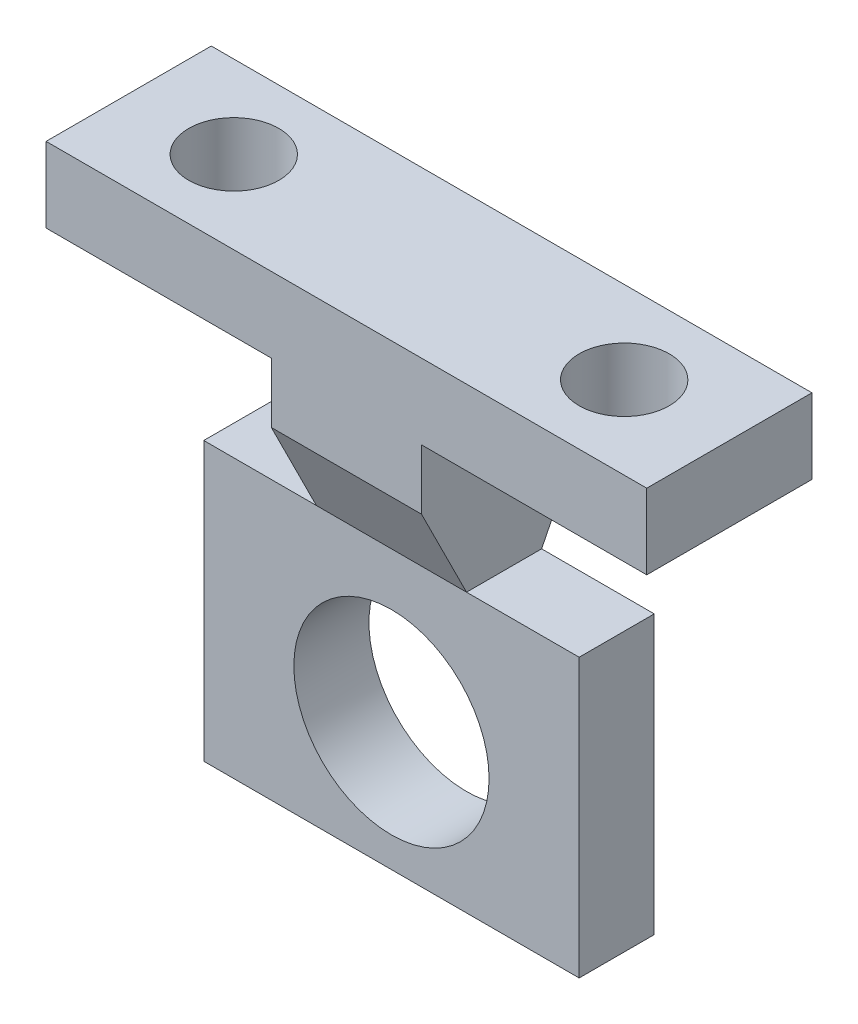
ISO-10303-21;
HEADER;
FILE_DESCRIPTION(('STEP AP214'),'2;1');
FILE_NAME('part.step','',(''),(''),'','','');
FILE_SCHEMA(('AUTOMOTIVE_DESIGN { 1 0 10303 214 1 1 1 1 }'));
ENDSEC;
DATA;
#1=APPLICATION_CONTEXT('core data for automotive mechanical design processes');
#2=APPLICATION_PROTOCOL_DEFINITION('international standard','automotive_design',2000,#1);
#3=PRODUCT_CONTEXT('',#1,'mechanical');
#4=PRODUCT('Part','Part','',(#3));
#5=PRODUCT_RELATED_PRODUCT_CATEGORY('part','',(#4));
#6=PRODUCT_DEFINITION_FORMATION('','',#4);
#7=PRODUCT_DEFINITION_CONTEXT('part definition',#1,'design');
#8=PRODUCT_DEFINITION('design','',#6,#7);
#9=PRODUCT_DEFINITION_SHAPE('','',#8);
#10=(LENGTH_UNIT() NAMED_UNIT(*) SI_UNIT(.MILLI.,.METRE.));
#11=(NAMED_UNIT(*) PLANE_ANGLE_UNIT() SI_UNIT($,.RADIAN.));
#12=(NAMED_UNIT(*) SI_UNIT($,.STERADIAN.) SOLID_ANGLE_UNIT());
#13=UNCERTAINTY_MEASURE_WITH_UNIT(LENGTH_MEASURE(1.E-05),#10,'distance_accuracy_value','');
#14=(GEOMETRIC_REPRESENTATION_CONTEXT(3) GLOBAL_UNCERTAINTY_ASSIGNED_CONTEXT((#13)) GLOBAL_UNIT_ASSIGNED_CONTEXT((#10,
#11,#12)) REPRESENTATION_CONTEXT('',''));
#15=CARTESIAN_POINT('',(0.,0.,0.));
#16=DIRECTION('',(0.,0.,1.));
#17=DIRECTION('',(1.,0.,0.));
#18=AXIS2_PLACEMENT_3D('',#15,#16,#17);
#19=CARTESIAN_POINT('',(40.,0.,-0.0001));
#20=DIRECTION('',(1.,0.,0.));
#21=DIRECTION('',(0.,0.,-1.));
#22=AXIS2_PLACEMENT_3D('',#19,#20,#21);
#23=PLANE('',#22);
#24=DIRECTION('',(0.,1.,0.));
#25=VECTOR('',#24,1.);
#26=CARTESIAN_POINT('',(40.,40.,2.));
#27=LINE('',#26,#25);
#28=CARTESIAN_POINT('',(40.,45.,2.));
#29=VERTEX_POINT('',#28);
#30=CARTESIAN_POINT('',(40.,50.,2.));
#31=VERTEX_POINT('',#30);
#32=EDGE_CURVE('E267',#29,#31,#27,.T.);
#33=ORIENTED_EDGE('',*,*,#32,.T.);
#34=DIRECTION('',(0.,0.,1.));
#35=VECTOR('',#34,1.);
#36=CARTESIAN_POINT('',(40.,50.,-0.0001));
#37=LINE('',#36,#35);
#38=CARTESIAN_POINT('',(40.,50.,13.));
#39=VERTEX_POINT('',#38);
#40=EDGE_CURVE('E270',#31,#39,#37,.T.);
#41=ORIENTED_EDGE('',*,*,#40,.T.);
#42=DIRECTION('',(0.,1.,0.));
#43=VECTOR('',#42,1.);
#44=CARTESIAN_POINT('',(40.,40.,13.));
#45=LINE('',#44,#43);
#46=CARTESIAN_POINT('',(40.,45.,13.));
#47=VERTEX_POINT('',#46);
#48=EDGE_CURVE('E215',#47,#39,#45,.T.);
#49=ORIENTED_EDGE('',*,*,#48,.F.);
#50=DIRECTION('',(0.,0.,-1.));
#51=VECTOR('',#50,1.);
#52=CARTESIAN_POINT('',(40.,45.,29.9999));
#53=LINE('',#52,#51);
#54=EDGE_CURVE('E262',#47,#29,#53,.T.);
#55=ORIENTED_EDGE('',*,*,#54,.T.);
#56=EDGE_LOOP('',(#33,#41,#49,#55));
#57=FACE_BOUND('',#56,.T.);
#58=ADVANCED_FACE('F53',(#57),#23,.T.);
#59=CARTESIAN_POINT('',(0.,0.,-0.0001));
#60=DIRECTION('',(-1.,0.,0.));
#61=DIRECTION('',(0.,0.,1.));
#62=AXIS2_PLACEMENT_3D('',#59,#60,#61);
#63=PLANE('',#62);
#64=DIRECTION('',(0.,1.,0.));
#65=VECTOR('',#64,1.);
#66=CARTESIAN_POINT('',(0.,40.,2.));
#67=LINE('',#66,#65);
#68=CARTESIAN_POINT('',(0.,45.,2.));
#69=VERTEX_POINT('',#68);
#70=CARTESIAN_POINT('',(0.,50.,2.));
#71=VERTEX_POINT('',#70);
#72=EDGE_CURVE('E63',#69,#71,#67,.T.);
#73=ORIENTED_EDGE('',*,*,#72,.F.);
#74=DIRECTION('',(0.,0.,-1.));
#75=VECTOR('',#74,1.);
#76=CARTESIAN_POINT('',(0.,45.,29.9999));
#77=LINE('',#76,#75);
#78=CARTESIAN_POINT('',(0.,45.,13.));
#79=VERTEX_POINT('',#78);
#80=EDGE_CURVE('E222',#79,#69,#77,.T.);
#81=ORIENTED_EDGE('',*,*,#80,.F.);
#82=DIRECTION('',(0.,1.,0.));
#83=VECTOR('',#82,1.);
#84=CARTESIAN_POINT('',(0.,40.,13.));
#85=LINE('',#84,#83);
#86=CARTESIAN_POINT('',(0.,50.,13.));
#87=VERTEX_POINT('',#86);
#88=EDGE_CURVE('E257',#79,#87,#85,.T.);
#89=ORIENTED_EDGE('',*,*,#88,.T.);
#90=DIRECTION('',(0.,0.,1.));
#91=VECTOR('',#90,1.);
#92=CARTESIAN_POINT('',(0.,50.,-0.0001));
#93=LINE('',#92,#91);
#94=EDGE_CURVE('E261',#71,#87,#93,.T.);
#95=ORIENTED_EDGE('',*,*,#94,.F.);
#96=EDGE_LOOP('',(#73,#81,#89,#95));
#97=FACE_BOUND('',#96,.T.);
#98=ADVANCED_FACE('F55',(#97),#63,.T.);
#99=CARTESIAN_POINT('',(0.,50.,-0.0001));
#100=DIRECTION('',(0.,1.,0.));
#101=DIRECTION('',(0.,0.,1.));
#102=AXIS2_PLACEMENT_3D('',#99,#100,#101);
#103=PLANE('',#102);
#104=DIRECTION('',(1.,0.,0.));
#105=VECTOR('',#104,1.);
#106=CARTESIAN_POINT('',(0.,50.,2.));
#107=LINE('',#106,#105);
#108=EDGE_CURVE('E12',#71,#31,#107,.T.);
#109=ORIENTED_EDGE('',*,*,#108,.F.);
#110=ORIENTED_EDGE('',*,*,#94,.T.);
#111=DIRECTION('',(-1.,0.,0.));
#112=VECTOR('',#111,1.);
#113=CARTESIAN_POINT('',(0.,50.,13.));
#114=LINE('',#113,#112);
#115=EDGE_CURVE('E256',#39,#87,#114,.T.);
#116=ORIENTED_EDGE('',*,*,#115,.F.);
#117=ORIENTED_EDGE('',*,*,#40,.F.);
#118=EDGE_LOOP('',(#109,#110,#116,#117));
#119=FACE_BOUND('',#118,.T.);
#120=CARTESIAN_POINT('',(7.,50.,7.50000000000001));
#121=DIRECTION('',(0.,1.,0.));
#122=DIRECTION('',(0.,0.,1.));
#123=AXIS2_PLACEMENT_3D('',#120,#121,#122);
#124=CIRCLE('',#123,3.);
#125=CARTESIAN_POINT('',(7.,50.,10.5));
#126=VERTEX_POINT('',#125);
#127=EDGE_CURVE('E324',#126,#126,#124,.T.);
#128=ORIENTED_EDGE('',*,*,#127,.F.);
#129=EDGE_LOOP('',(#128));
#130=FACE_BOUND('',#129,.T.);
#131=CARTESIAN_POINT('',(33.,50.,7.50000000000001));
#132=DIRECTION('',(0.,1.,0.));
#133=DIRECTION('',(0.,0.,1.));
#134=AXIS2_PLACEMENT_3D('',#131,#132,#133);
#135=CIRCLE('',#134,3.);
#136=CARTESIAN_POINT('',(33.,50.,10.5));
#137=VERTEX_POINT('',#136);
#138=EDGE_CURVE('E317',#137,#137,#135,.T.);
#139=ORIENTED_EDGE('',*,*,#138,.F.);
#140=EDGE_LOOP('',(#139));
#141=FACE_BOUND('',#140,.T.);
#142=ADVANCED_FACE('F362',(#119,#130,#141),#103,.T.);
#143=CARTESIAN_POINT('',(15.,35.,29.9999));
#144=DIRECTION('',(0.,-1.,0.));
#145=DIRECTION('',(0.,0.,-1.));
#146=AXIS2_PLACEMENT_3D('',#143,#144,#145);
#147=PLANE('',#146);
#148=DIRECTION('',(1.,0.,0.));
#149=VECTOR('',#148,1.);
#150=CARTESIAN_POINT('',(40.,35.,4.9999));
#151=LINE('',#150,#149);
#152=CARTESIAN_POINT('',(7.5,35.,4.9999));
#153=VERTEX_POINT('',#152);
#154=CARTESIAN_POINT('',(15.,35.,4.9999));
#155=VERTEX_POINT('',#154);
#156=EDGE_CURVE('E189',#153,#155,#151,.T.);
#157=ORIENTED_EDGE('',*,*,#156,.F.);
#158=DIRECTION('',(0.,0.,-1.));
#159=VECTOR('',#158,1.);
#160=CARTESIAN_POINT('',(7.5,35.,14.9999));
#161=LINE('',#160,#159);
#162=CARTESIAN_POINT('',(7.5,35.,10.));
#163=VERTEX_POINT('',#162);
#164=EDGE_CURVE('E73',#163,#153,#161,.T.);
#165=ORIENTED_EDGE('',*,*,#164,.F.);
#166=DIRECTION('',(-1.,0.,0.));
#167=VECTOR('',#166,1.);
#168=CARTESIAN_POINT('',(0.,35.,10.));
#169=LINE('',#168,#167);
#170=CARTESIAN_POINT('',(15.,35.,10.));
#171=VERTEX_POINT('',#170);
#172=EDGE_CURVE('E200',#171,#163,#169,.T.);
#173=ORIENTED_EDGE('',*,*,#172,.F.);
#174=DIRECTION('',(0.,0.,-1.));
#175=VECTOR('',#174,1.);
#176=CARTESIAN_POINT('',(15.,35.,29.9999));
#177=LINE('',#176,#175);
#178=EDGE_CURVE('E276',#171,#155,#177,.T.);
#179=ORIENTED_EDGE('',*,*,#178,.T.);
#180=EDGE_LOOP('',(#157,#165,#173,#179));
#181=FACE_BOUND('',#180,.T.);
#182=ADVANCED_FACE('F368',(#181),#147,.F.);
#183=CARTESIAN_POINT('',(15.,45.,29.9999));
#184=DIRECTION('',(1.,0.,0.));
#185=DIRECTION('',(0.,0.,-1.));
#186=AXIS2_PLACEMENT_3D('',#183,#184,#185);
#187=PLANE('',#186);
#188=DIRECTION('',(0.,0.,-1.));
#189=VECTOR('',#188,1.);
#190=CARTESIAN_POINT('',(15.,45.,29.9999));
#191=LINE('',#190,#189);
#192=CARTESIAN_POINT('',(15.,45.,13.));
#193=VERTEX_POINT('',#192);
#194=CARTESIAN_POINT('',(15.,45.,2.));
#195=VERTEX_POINT('',#194);
#196=EDGE_CURVE('E228',#193,#195,#191,.T.);
#197=ORIENTED_EDGE('',*,*,#196,.T.);
#198=DIRECTION('',(0.,-1.,0.));
#199=VECTOR('',#198,1.);
#200=CARTESIAN_POINT('',(15.,45.,2.));
#201=LINE('',#200,#199);
#202=CARTESIAN_POINT('',(15.,40.9998,2.));
#203=VERTEX_POINT('',#202);
#204=EDGE_CURVE('E223',#195,#203,#201,.T.);
#205=ORIENTED_EDGE('',*,*,#204,.T.);
#206=DIRECTION('',(0.,0.894427190999916,-0.447213595499958));
#207=VECTOR('',#206,1.);
#208=CARTESIAN_POINT('',(15.,35.,4.9999));
#209=LINE('',#208,#207);
#210=EDGE_CURVE('E57',#155,#203,#209,.T.);
#211=ORIENTED_EDGE('',*,*,#210,.F.);
#212=ORIENTED_EDGE('',*,*,#178,.F.);
#213=DIRECTION('',(0.,-0.894427190999916,-0.447213595499958));
#214=VECTOR('',#213,1.);
#215=CARTESIAN_POINT('',(15.,45.,15.));
#216=LINE('',#215,#214);
#217=CARTESIAN_POINT('',(15.,41.,13.));
#218=VERTEX_POINT('',#217);
#219=EDGE_CURVE('E212',#218,#171,#216,.T.);
#220=ORIENTED_EDGE('',*,*,#219,.F.);
#221=DIRECTION('',(0.,1.,0.));
#222=VECTOR('',#221,1.);
#223=CARTESIAN_POINT('',(15.,45.,13.));
#224=LINE('',#223,#222);
#225=EDGE_CURVE('E227',#218,#193,#224,.T.);
#226=ORIENTED_EDGE('',*,*,#225,.T.);
#227=EDGE_LOOP('',(#197,#205,#211,#212,#220,#226));
#228=FACE_BOUND('',#227,.T.);
#229=ADVANCED_FACE('F371',(#228),#187,.F.);
#230=CARTESIAN_POINT('',(0.,45.,29.9999));
#231=DIRECTION('',(0.,1.,0.));
#232=DIRECTION('',(0.,0.,1.));
#233=AXIS2_PLACEMENT_3D('',#230,#231,#232);
#234=PLANE('',#233);
#235=CARTESIAN_POINT('',(7.,45.,7.50000000000001));
#236=DIRECTION('',(0.,1.,0.));
#237=DIRECTION('',(0.,0.,1.));
#238=AXIS2_PLACEMENT_3D('',#235,#236,#237);
#239=CIRCLE('',#238,3.);
#240=CARTESIAN_POINT('',(7.,45.,10.5));
#241=VERTEX_POINT('',#240);
#242=EDGE_CURVE('E247',#241,#241,#239,.T.);
#243=ORIENTED_EDGE('',*,*,#242,.T.);
#244=EDGE_LOOP('',(#243));
#245=FACE_BOUND('',#244,.T.);
#246=ORIENTED_EDGE('',*,*,#80,.T.);
#247=DIRECTION('',(1.,0.,0.));
#248=VECTOR('',#247,1.);
#249=CARTESIAN_POINT('',(0.,45.,2.));
#250=LINE('',#249,#248);
#251=EDGE_CURVE('E217',#69,#195,#250,.T.);
#252=ORIENTED_EDGE('',*,*,#251,.T.);
#253=ORIENTED_EDGE('',*,*,#196,.F.);
#254=DIRECTION('',(-1.,0.,0.));
#255=VECTOR('',#254,1.);
#256=CARTESIAN_POINT('',(0.,45.,13.));
#257=LINE('',#256,#255);
#258=EDGE_CURVE('E221',#193,#79,#257,.T.);
#259=ORIENTED_EDGE('',*,*,#258,.T.);
#260=EDGE_LOOP('',(#246,#252,#253,#259));
#261=FACE_BOUND('',#260,.T.);
#262=ADVANCED_FACE('F413',(#245,#261),#234,.F.);
#263=CARTESIAN_POINT('',(40.,45.,29.9999));
#264=DIRECTION('',(0.,1.,0.));
#265=DIRECTION('',(0.,0.,1.));
#266=AXIS2_PLACEMENT_3D('',#263,#264,#265);
#267=PLANE('',#266);
#268=CARTESIAN_POINT('',(33.,45.,7.50000000000001));
#269=DIRECTION('',(0.,1.,0.));
#270=DIRECTION('',(0.,0.,1.));
#271=AXIS2_PLACEMENT_3D('',#268,#269,#270);
#272=CIRCLE('',#271,3.);
#273=CARTESIAN_POINT('',(33.,45.,10.5));
#274=VERTEX_POINT('',#273);
#275=EDGE_CURVE('E243',#274,#274,#272,.T.);
#276=ORIENTED_EDGE('',*,*,#275,.T.);
#277=EDGE_LOOP('',(#276));
#278=FACE_BOUND('',#277,.T.);
#279=DIRECTION('',(0.,0.,-1.));
#280=VECTOR('',#279,1.);
#281=CARTESIAN_POINT('',(25.,45.,29.9999));
#282=LINE('',#281,#280);
#283=CARTESIAN_POINT('',(25.,45.,13.));
#284=VERTEX_POINT('',#283);
#285=CARTESIAN_POINT('',(25.,45.,2.));
#286=VERTEX_POINT('',#285);
#287=EDGE_CURVE('E234',#284,#286,#282,.T.);
#288=ORIENTED_EDGE('',*,*,#287,.T.);
#289=DIRECTION('',(1.,0.,0.));
#290=VECTOR('',#289,1.);
#291=CARTESIAN_POINT('',(40.,45.,2.));
#292=LINE('',#291,#290);
#293=EDGE_CURVE('E229',#286,#29,#292,.T.);
#294=ORIENTED_EDGE('',*,*,#293,.T.);
#295=ORIENTED_EDGE('',*,*,#54,.F.);
#296=DIRECTION('',(-1.,0.,0.));
#297=VECTOR('',#296,1.);
#298=CARTESIAN_POINT('',(40.,45.,13.));
#299=LINE('',#298,#297);
#300=EDGE_CURVE('E233',#47,#284,#299,.T.);
#301=ORIENTED_EDGE('',*,*,#300,.T.);
#302=EDGE_LOOP('',(#288,#294,#295,#301));
#303=FACE_BOUND('',#302,.T.);
#304=ADVANCED_FACE('F424',(#278,#303),#267,.F.);
#305=CARTESIAN_POINT('',(25.,45.,29.9999));
#306=DIRECTION('',(-1.,0.,0.));
#307=DIRECTION('',(0.,0.,1.));
#308=AXIS2_PLACEMENT_3D('',#305,#306,#307);
#309=PLANE('',#308);
#310=DIRECTION('',(0.,0.894427190999916,-0.447213595499958));
#311=VECTOR('',#310,1.);
#312=CARTESIAN_POINT('',(25.,33.,5.99989999999999));
#313=LINE('',#312,#311);
#314=CARTESIAN_POINT('',(25.,35.,4.9999));
#315=VERTEX_POINT('',#314);
#316=CARTESIAN_POINT('',(25.,40.9998,1.99999999999999));
#317=VERTEX_POINT('',#316);
#318=EDGE_CURVE('E239',#315,#317,#313,.T.);
#319=ORIENTED_EDGE('',*,*,#318,.T.);
#320=DIRECTION('',(0.,1.,0.));
#321=VECTOR('',#320,1.);
#322=CARTESIAN_POINT('',(25.,45.,2.));
#323=LINE('',#322,#321);
#324=EDGE_CURVE('E235',#317,#286,#323,.T.);
#325=ORIENTED_EDGE('',*,*,#324,.T.);
#326=ORIENTED_EDGE('',*,*,#287,.F.);
#327=DIRECTION('',(0.,-1.,0.));
#328=VECTOR('',#327,1.);
#329=CARTESIAN_POINT('',(25.,45.,13.));
#330=LINE('',#329,#328);
#331=CARTESIAN_POINT('',(25.,41.,13.));
#332=VERTEX_POINT('',#331);
#333=EDGE_CURVE('E211',#284,#332,#330,.T.);
#334=ORIENTED_EDGE('',*,*,#333,.T.);
#335=DIRECTION('',(0.,-0.894427190999916,-0.447213595499958));
#336=VECTOR('',#335,1.);
#337=CARTESIAN_POINT('',(25.,50.99996,17.99998));
#338=LINE('',#337,#336);
#339=CARTESIAN_POINT('',(25.,35.,10.));
#340=VERTEX_POINT('',#339);
#341=EDGE_CURVE('E206',#332,#340,#338,.T.);
#342=ORIENTED_EDGE('',*,*,#341,.T.);
#343=DIRECTION('',(0.,0.,-1.));
#344=VECTOR('',#343,1.);
#345=CARTESIAN_POINT('',(25.,35.,29.9999));
#346=LINE('',#345,#344);
#347=EDGE_CURVE('E210',#340,#315,#346,.T.);
#348=ORIENTED_EDGE('',*,*,#347,.T.);
#349=EDGE_LOOP('',(#319,#325,#326,#334,#342,#348));
#350=FACE_BOUND('',#349,.T.);
#351=ADVANCED_FACE('F288',(#350),#309,.F.);
#352=CARTESIAN_POINT('',(25.,35.,29.9999));
#353=DIRECTION('',(0.,-1.,0.));
#354=DIRECTION('',(0.,0.,-1.));
#355=AXIS2_PLACEMENT_3D('',#352,#353,#354);
#356=PLANE('',#355);
#357=CARTESIAN_POINT('',(32.5,35.,10.));
#358=VERTEX_POINT('',#357);
#359=EDGE_CURVE('E178',#358,#340,#169,.T.);
#360=ORIENTED_EDGE('',*,*,#359,.F.);
#361=DIRECTION('',(0.,0.,-1.));
#362=VECTOR('',#361,1.);
#363=CARTESIAN_POINT('',(32.5,35.,14.9999));
#364=LINE('',#363,#362);
#365=CARTESIAN_POINT('',(32.5,35.,4.9999));
#366=VERTEX_POINT('',#365);
#367=EDGE_CURVE('E162',#358,#366,#364,.T.);
#368=ORIENTED_EDGE('',*,*,#367,.T.);
#369=EDGE_CURVE('E176',#315,#366,#151,.T.);
#370=ORIENTED_EDGE('',*,*,#369,.F.);
#371=ORIENTED_EDGE('',*,*,#347,.F.);
#372=EDGE_LOOP('',(#360,#368,#370,#371));
#373=FACE_BOUND('',#372,.T.);
#374=ADVANCED_FACE('F174',(#373),#356,.F.);
#375=CARTESIAN_POINT('',(33.,40.,7.50000000000001));
#376=DIRECTION('',(0.,1.,0.));
#377=DIRECTION('',(0.,0.,1.));
#378=AXIS2_PLACEMENT_3D('',#375,#376,#377);
#379=CYLINDRICAL_SURFACE('',#378,3.);
#380=ORIENTED_EDGE('',*,*,#138,.T.);
#381=EDGE_LOOP('',(#380));
#382=FACE_BOUND('',#381,.T.);
#383=ORIENTED_EDGE('',*,*,#275,.F.);
#384=EDGE_LOOP('',(#383));
#385=FACE_BOUND('',#384,.T.);
#386=ADVANCED_FACE('F375',(#382,#385),#379,.F.);
#387=CARTESIAN_POINT('',(7.,40.,7.50000000000001));
#388=DIRECTION('',(0.,1.,0.));
#389=DIRECTION('',(0.,0.,1.));
#390=AXIS2_PLACEMENT_3D('',#387,#388,#389);
#391=CYLINDRICAL_SURFACE('',#390,3.);
#392=ORIENTED_EDGE('',*,*,#127,.T.);
#393=EDGE_LOOP('',(#392));
#394=FACE_BOUND('',#393,.T.);
#395=ORIENTED_EDGE('',*,*,#242,.F.);
#396=EDGE_LOOP('',(#395));
#397=FACE_BOUND('',#396,.T.);
#398=ADVANCED_FACE('F378',(#394,#397),#391,.F.);
#399=CARTESIAN_POINT('',(20.,25.0016548127547,1.5));
#400=DIRECTION('',(0.,0.,1.));
#401=DIRECTION('',(1.,0.,0.));
#402=AXIS2_PLACEMENT_3D('',#399,#400,#401);
#403=CYLINDRICAL_SURFACE('',#402,6.5);
#404=CARTESIAN_POINT('',(20.,25.0016548127547,4.9999));
#405=DIRECTION('',(0.,0.,1.));
#406=DIRECTION('',(1.,0.,0.));
#407=AXIS2_PLACEMENT_3D('',#404,#405,#406);
#408=CIRCLE('',#407,6.5);
#409=CARTESIAN_POINT('',(26.5,25.0016548127547,4.9999));
#410=VERTEX_POINT('',#409);
#411=EDGE_CURVE('E328',#410,#410,#408,.F.);
#412=ORIENTED_EDGE('',*,*,#411,.T.);
#413=EDGE_LOOP('',(#412));
#414=FACE_BOUND('',#413,.T.);
#415=CARTESIAN_POINT('',(20.,25.0016548127547,10.));
#416=DIRECTION('',(0.,0.,-1.));
#417=DIRECTION('',(-1.,0.,0.));
#418=AXIS2_PLACEMENT_3D('',#415,#416,#417);
#419=CIRCLE('',#418,6.5);
#420=CARTESIAN_POINT('',(13.5,25.0016548127547,10.));
#421=VERTEX_POINT('',#420);
#422=EDGE_CURVE('E329',#421,#421,#419,.F.);
#423=ORIENTED_EDGE('',*,*,#422,.T.);
#424=EDGE_LOOP('',(#423));
#425=FACE_BOUND('',#424,.T.);
#426=ADVANCED_FACE('F341',(#414,#425),#403,.F.);
#427=CARTESIAN_POINT('',(0.,16.5,1.5));
#428=DIRECTION('',(0.,-1.,0.));
#429=DIRECTION('',(0.,0.,-1.));
#430=AXIS2_PLACEMENT_3D('',#427,#428,#429);
#431=PLANE('',#430);
#432=DIRECTION('',(0.,0.,-1.));
#433=VECTOR('',#432,1.);
#434=CARTESIAN_POINT('',(32.5,16.5,14.9999));
#435=LINE('',#434,#433);
#436=CARTESIAN_POINT('',(32.5,16.5,10.));
#437=VERTEX_POINT('',#436);
#438=CARTESIAN_POINT('',(32.5,16.5,4.9999));
#439=VERTEX_POINT('',#438);
#440=EDGE_CURVE('E81',#437,#439,#435,.T.);
#441=ORIENTED_EDGE('',*,*,#440,.F.);
#442=DIRECTION('',(1.,0.,0.));
#443=VECTOR('',#442,1.);
#444=CARTESIAN_POINT('',(40.,16.5,10.));
#445=LINE('',#444,#443);
#446=CARTESIAN_POINT('',(7.5,16.5,10.));
#447=VERTEX_POINT('',#446);
#448=EDGE_CURVE('E332',#447,#437,#445,.T.);
#449=ORIENTED_EDGE('',*,*,#448,.F.);
#450=DIRECTION('',(0.,0.,-1.));
#451=VECTOR('',#450,1.);
#452=CARTESIAN_POINT('',(7.5,16.5,14.9999));
#453=LINE('',#452,#451);
#454=CARTESIAN_POINT('',(7.5,16.5,4.9999));
#455=VERTEX_POINT('',#454);
#456=EDGE_CURVE('E169',#447,#455,#453,.T.);
#457=ORIENTED_EDGE('',*,*,#456,.T.);
#458=DIRECTION('',(-1.,0.,0.));
#459=VECTOR('',#458,1.);
#460=CARTESIAN_POINT('',(0.,16.5,4.9999));
#461=LINE('',#460,#459);
#462=EDGE_CURVE('E197',#439,#455,#461,.T.);
#463=ORIENTED_EDGE('',*,*,#462,.F.);
#464=EDGE_LOOP('',(#441,#449,#457,#463));
#465=FACE_BOUND('',#464,.T.);
#466=ADVANCED_FACE('F352',(#465),#431,.T.);
#467=CARTESIAN_POINT('',(0.,0.,10.));
#468=DIRECTION('',(0.,0.,-1.));
#469=DIRECTION('',(-1.,0.,0.));
#470=AXIS2_PLACEMENT_3D('',#467,#468,#469);
#471=PLANE('',#470);
#472=ORIENTED_EDGE('',*,*,#448,.T.);
#473=DIRECTION('',(0.,1.,0.));
#474=VECTOR('',#473,1.);
#475=CARTESIAN_POINT('',(32.5,0.,10.));
#476=LINE('',#475,#474);
#477=EDGE_CURVE('E271',#437,#358,#476,.T.);
#478=ORIENTED_EDGE('',*,*,#477,.T.);
#479=ORIENTED_EDGE('',*,*,#359,.T.);
#480=EDGE_CURVE('E203',#340,#171,#169,.T.);
#481=ORIENTED_EDGE('',*,*,#480,.T.);
#482=ORIENTED_EDGE('',*,*,#172,.T.);
#483=DIRECTION('',(0.,-1.,0.));
#484=VECTOR('',#483,1.);
#485=CARTESIAN_POINT('',(7.49999999999999,0.,10.));
#486=LINE('',#485,#484);
#487=EDGE_CURVE('E180',#163,#447,#486,.T.);
#488=ORIENTED_EDGE('',*,*,#487,.T.);
#489=EDGE_LOOP('',(#472,#478,#479,#481,#482,#488));
#490=FACE_BOUND('',#489,.T.);
#491=ORIENTED_EDGE('',*,*,#422,.F.);
#492=EDGE_LOOP('',(#491));
#493=FACE_BOUND('',#492,.T.);
#494=ADVANCED_FACE('F344',(#490,#493),#471,.F.);
#495=CARTESIAN_POINT('',(0.,0.,4.9999));
#496=DIRECTION('',(0.,0.,1.));
#497=DIRECTION('',(1.,0.,0.));
#498=AXIS2_PLACEMENT_3D('',#495,#496,#497);
#499=PLANE('',#498);
#500=ORIENTED_EDGE('',*,*,#369,.T.);
#501=DIRECTION('',(0.,1.,0.));
#502=VECTOR('',#501,1.);
#503=CARTESIAN_POINT('',(32.5,35.,4.9999));
#504=LINE('',#503,#502);
#505=EDGE_CURVE('E159',#439,#366,#504,.T.);
#506=ORIENTED_EDGE('',*,*,#505,.F.);
#507=ORIENTED_EDGE('',*,*,#462,.T.);
#508=DIRECTION('',(0.,-1.,0.));
#509=VECTOR('',#508,1.);
#510=CARTESIAN_POINT('',(7.5,35.,4.9999));
#511=LINE('',#510,#509);
#512=EDGE_CURVE('E402',#153,#455,#511,.T.);
#513=ORIENTED_EDGE('',*,*,#512,.F.);
#514=ORIENTED_EDGE('',*,*,#156,.T.);
#515=EDGE_CURVE('E186',#155,#315,#151,.T.);
#516=ORIENTED_EDGE('',*,*,#515,.T.);
#517=EDGE_LOOP('',(#500,#506,#507,#513,#514,#516));
#518=FACE_BOUND('',#517,.T.);
#519=ORIENTED_EDGE('',*,*,#411,.F.);
#520=EDGE_LOOP('',(#519));
#521=FACE_BOUND('',#520,.T.);
#522=ADVANCED_FACE('F183',(#518,#521),#499,.F.);
#523=CARTESIAN_POINT('',(165.,35.,4.9999));
#524=DIRECTION('',(0.,0.447213595499958,0.894427190999916));
#525=DIRECTION('',(0.,-0.894427190999916,0.447213595499958));
#526=AXIS2_PLACEMENT_3D('',#523,#524,#525);
#527=PLANE('',#526);
#528=ORIENTED_EDGE('',*,*,#210,.T.);
#529=DIRECTION('',(1.,0.,0.));
#530=VECTOR('',#529,1.);
#531=CARTESIAN_POINT('',(165.,40.9998,2.));
#532=LINE('',#531,#530);
#533=EDGE_CURVE('E193',#203,#317,#532,.T.);
#534=ORIENTED_EDGE('',*,*,#533,.T.);
#535=ORIENTED_EDGE('',*,*,#318,.F.);
#536=ORIENTED_EDGE('',*,*,#515,.F.);
#537=EDGE_LOOP('',(#528,#534,#535,#536));
#538=FACE_BOUND('',#537,.T.);
#539=ADVANCED_FACE('F292',(#538),#527,.F.);
#540=CARTESIAN_POINT('',(165.,45.,15.));
#541=DIRECTION('',(0.,0.447213595499958,-0.894427190999916));
#542=DIRECTION('',(0.,0.894427190999916,0.447213595499958));
#543=AXIS2_PLACEMENT_3D('',#540,#541,#542);
#544=PLANE('',#543);
#545=ORIENTED_EDGE('',*,*,#341,.F.);
#546=DIRECTION('',(-1.,0.,0.));
#547=VECTOR('',#546,1.);
#548=CARTESIAN_POINT('',(165.,41.,13.));
#549=LINE('',#548,#547);
#550=EDGE_CURVE('E216',#332,#218,#549,.T.);
#551=ORIENTED_EDGE('',*,*,#550,.T.);
#552=ORIENTED_EDGE('',*,*,#219,.T.);
#553=ORIENTED_EDGE('',*,*,#480,.F.);
#554=EDGE_LOOP('',(#545,#551,#552,#553));
#555=FACE_BOUND('',#554,.T.);
#556=ADVANCED_FACE('F350',(#555),#544,.F.);
#557=CARTESIAN_POINT('',(0.,40.,13.));
#558=DIRECTION('',(0.,0.,-1.));
#559=DIRECTION('',(-1.,0.,0.));
#560=AXIS2_PLACEMENT_3D('',#557,#558,#559);
#561=PLANE('',#560);
#562=ORIENTED_EDGE('',*,*,#225,.F.);
#563=ORIENTED_EDGE('',*,*,#550,.F.);
#564=ORIENTED_EDGE('',*,*,#333,.F.);
#565=ORIENTED_EDGE('',*,*,#300,.F.);
#566=ORIENTED_EDGE('',*,*,#48,.T.);
#567=ORIENTED_EDGE('',*,*,#115,.T.);
#568=ORIENTED_EDGE('',*,*,#88,.F.);
#569=ORIENTED_EDGE('',*,*,#258,.F.);
#570=EDGE_LOOP('',(#562,#563,#564,#565,#566,#567,#568,#569));
#571=FACE_BOUND('',#570,.T.);
#572=ADVANCED_FACE('F430',(#571),#561,.F.);
#573=CARTESIAN_POINT('',(0.,40.,2.));
#574=DIRECTION('',(0.,0.,1.));
#575=DIRECTION('',(1.,0.,0.));
#576=AXIS2_PLACEMENT_3D('',#573,#574,#575);
#577=PLANE('',#576);
#578=ORIENTED_EDGE('',*,*,#72,.T.);
#579=ORIENTED_EDGE('',*,*,#108,.T.);
#580=ORIENTED_EDGE('',*,*,#32,.F.);
#581=ORIENTED_EDGE('',*,*,#293,.F.);
#582=ORIENTED_EDGE('',*,*,#324,.F.);
#583=ORIENTED_EDGE('',*,*,#533,.F.);
#584=ORIENTED_EDGE('',*,*,#204,.F.);
#585=ORIENTED_EDGE('',*,*,#251,.F.);
#586=EDGE_LOOP('',(#578,#579,#580,#581,#582,#583,#584,#585));
#587=FACE_BOUND('',#586,.T.);
#588=ADVANCED_FACE('F410',(#587),#577,.F.);
#589=CARTESIAN_POINT('',(7.5,35.,14.9999));
#590=DIRECTION('',(1.,0.,0.));
#591=DIRECTION('',(0.,1.,0.));
#592=AXIS2_PLACEMENT_3D('',#589,#590,#591);
#593=PLANE('',#592);
#594=ORIENTED_EDGE('',*,*,#164,.T.);
#595=ORIENTED_EDGE('',*,*,#512,.T.);
#596=ORIENTED_EDGE('',*,*,#456,.F.);
#597=ORIENTED_EDGE('',*,*,#487,.F.);
#598=EDGE_LOOP('',(#594,#595,#596,#597));
#599=FACE_BOUND('',#598,.T.);
#600=ADVANCED_FACE('F366',(#599),#593,.F.);
#601=CARTESIAN_POINT('',(32.5,35.,14.9999));
#602=DIRECTION('',(-1.,0.,0.));
#603=DIRECTION('',(0.,0.,1.));
#604=AXIS2_PLACEMENT_3D('',#601,#602,#603);
#605=PLANE('',#604);
#606=ORIENTED_EDGE('',*,*,#440,.T.);
#607=ORIENTED_EDGE('',*,*,#505,.T.);
#608=ORIENTED_EDGE('',*,*,#367,.F.);
#609=ORIENTED_EDGE('',*,*,#477,.F.);
#610=EDGE_LOOP('',(#606,#607,#608,#609));
#611=FACE_BOUND('',#610,.T.);
#612=ADVANCED_FACE('F161',(#611),#605,.F.);
#613=CLOSED_SHELL('',(#58,#98,#142,#182,#229,#262,#304,#351,#374,#386,#398,#426,#466,#494,#522,
#539,#556,#572,#588,#600,#612));
#614=MANIFOLD_SOLID_BREP('B2',#613);
#615=CARTESIAN_POINT('',(165.,35.,4.9999));
#616=DIRECTION('',(0.,0.447213595499958,0.894427190999916));
#617=DIRECTION('',(0.,-0.894427190999916,0.447213595499958));
#618=AXIS2_PLACEMENT_3D('',#615,#616,#617);
#619=PLANE('',#618);
#620=DIRECTION('',(0.,0.894427190999916,-0.447213595499958));
#621=VECTOR('',#620,1.);
#622=CARTESIAN_POINT('',(25.,33.,5.99989999999999));
#623=LINE('',#622,#621);
#624=CARTESIAN_POINT('',(25.,44.999925,-6.25000000007977E-05));
#625=VERTEX_POINT('',#624);
#626=CARTESIAN_POINT('',(25.,45.,-0.0001));
#627=VERTEX_POINT('',#626);
#628=EDGE_CURVE('E637',#625,#627,#623,.T.);
#629=ORIENTED_EDGE('',*,*,#628,.F.);
#630=DIRECTION('',(-0.999999999984375,-4.99999999992188E-06,2.49999999996094E-06));
#631=VECTOR('',#630,1.);
#632=CARTESIAN_POINT('',(164.999937496094,45.0006249996875,-0.000412499843741032));
#633=LINE('',#632,#631);
#634=CARTESIAN_POINT('',(15.,44.999875,-3.74999999996369E-05));
#635=VERTEX_POINT('',#634);
#636=EDGE_CURVE('E603',#625,#635,#633,.T.);
#637=ORIENTED_EDGE('',*,*,#636,.T.);
#638=DIRECTION('',(0.,0.894427190999916,-0.447213595499958));
#639=VECTOR('',#638,1.);
#640=CARTESIAN_POINT('',(15.,35.,4.9999));
#641=LINE('',#640,#639);
#642=CARTESIAN_POINT('',(15.,45.,-0.0001));
#643=VERTEX_POINT('',#642);
#644=EDGE_CURVE('E641',#635,#643,#641,.T.);
#645=ORIENTED_EDGE('',*,*,#644,.T.);
#646=DIRECTION('',(-1.,0.,0.));
#647=VECTOR('',#646,1.);
#648=CARTESIAN_POINT('',(30.,45.,-0.0001));
#649=LINE('',#648,#647);
#650=EDGE_CURVE('E631',#627,#643,#649,.T.);
#651=ORIENTED_EDGE('',*,*,#650,.F.);
#652=EDGE_LOOP('',(#629,#637,#645,#651));
#653=FACE_BOUND('',#652,.T.);
#654=ADVANCED_FACE('F595',(#653),#619,.F.);
#655=CARTESIAN_POINT('',(25.,45.,29.9999));
#656=DIRECTION('',(-1.,0.,0.));
#657=DIRECTION('',(0.,0.,1.));
#658=AXIS2_PLACEMENT_3D('',#655,#656,#657);
#659=PLANE('',#658);
#660=DIRECTION('',(0.,0.,-1.));
#661=VECTOR('',#660,1.);
#662=CARTESIAN_POINT('',(25.,45.,29.9999));
#663=LINE('',#662,#661);
#664=CARTESIAN_POINT('',(25.,45.,-6.25E-05));
#665=VERTEX_POINT('',#664);
#666=EDGE_CURVE('E627',#665,#627,#663,.T.);
#667=ORIENTED_EDGE('',*,*,#666,.F.);
#668=DIRECTION('',(0.,-1.,0.));
#669=VECTOR('',#668,1.);
#670=CARTESIAN_POINT('',(25.,45.,-6.24999999983278E-05));
#671=LINE('',#670,#669);
#672=EDGE_CURVE('E639',#665,#625,#671,.T.);
#673=ORIENTED_EDGE('',*,*,#672,.T.);
#674=ORIENTED_EDGE('',*,*,#628,.T.);
#675=EDGE_LOOP('',(#667,#673,#674));
#676=FACE_BOUND('',#675,.T.);
#677=ADVANCED_FACE('F638',(#676),#659,.F.);
#678=CARTESIAN_POINT('',(15.,45.,29.9999));
#679=DIRECTION('',(1.,0.,0.));
#680=DIRECTION('',(0.,0.,-1.));
#681=AXIS2_PLACEMENT_3D('',#678,#679,#680);
#682=PLANE('',#681);
#683=ORIENTED_EDGE('',*,*,#644,.F.);
#684=DIRECTION('',(0.,1.,0.));
#685=VECTOR('',#684,1.);
#686=CARTESIAN_POINT('',(15.,45.,-3.75000000010783E-05));
#687=LINE('',#686,#685);
#688=CARTESIAN_POINT('',(15.,45.,-3.75000000010783E-05));
#689=VERTEX_POINT('',#688);
#690=EDGE_CURVE('E609',#635,#689,#687,.T.);
#691=ORIENTED_EDGE('',*,*,#690,.T.);
#692=DIRECTION('',(0.,0.,-1.));
#693=VECTOR('',#692,1.);
#694=CARTESIAN_POINT('',(15.,45.,29.9999));
#695=LINE('',#694,#693);
#696=EDGE_CURVE('E617',#689,#643,#695,.T.);
#697=ORIENTED_EDGE('',*,*,#696,.T.);
#698=EDGE_LOOP('',(#683,#691,#697));
#699=FACE_BOUND('',#698,.T.);
#700=ADVANCED_FACE('F597',(#699),#682,.F.);
#701=CARTESIAN_POINT('',(40.,40.,-0.0001));
#702=DIRECTION('',(-2.49999999999219E-06,0.,-0.999999999996875));
#703=DIRECTION('',(-0.999999999996875,0.,2.49999999999219E-06));
#704=AXIS2_PLACEMENT_3D('',#701,#702,#703);
#705=PLANE('',#704);
#706=ORIENTED_EDGE('',*,*,#672,.F.);
#707=DIRECTION('',(-0.999999999996875,0.,2.49999999999219E-06));
#708=VECTOR('',#707,1.);
#709=CARTESIAN_POINT('',(40.,45.,-0.0001));
#710=LINE('',#709,#708);
#711=EDGE_CURVE('E51',#665,#689,#710,.T.);
#712=ORIENTED_EDGE('',*,*,#711,.T.);
#713=ORIENTED_EDGE('',*,*,#690,.F.);
#714=ORIENTED_EDGE('',*,*,#636,.F.);
#715=EDGE_LOOP('',(#706,#712,#713,#714));
#716=FACE_BOUND('',#715,.T.);
#717=ADVANCED_FACE('F652',(#716),#705,.F.);
#718=CARTESIAN_POINT('',(0.,45.,0.9999));
#719=DIRECTION('',(0.,-1.,0.));
#720=DIRECTION('',(0.,0.,-1.));
#721=AXIS2_PLACEMENT_3D('',#718,#719,#720);
#722=PLANE('',#721);
#723=ORIENTED_EDGE('',*,*,#650,.T.);
#724=ORIENTED_EDGE('',*,*,#696,.F.);
#725=ORIENTED_EDGE('',*,*,#711,.F.);
#726=ORIENTED_EDGE('',*,*,#666,.T.);
#727=EDGE_LOOP('',(#723,#724,#725,#726));
#728=FACE_BOUND('',#727,.T.);
#729=ADVANCED_FACE('F629',(#728),#722,.F.);
#730=CLOSED_SHELL('',(#654,#677,#700,#717,#729));
#731=MANIFOLD_SOLID_BREP('B6',#730);
#732=ADVANCED_BREP_SHAPE_REPRESENTATION('',(#18,#614,#731),#14);
#733=SHAPE_DEFINITION_REPRESENTATION(#9,#732);
ENDSEC;
END-ISO-10303-21;
